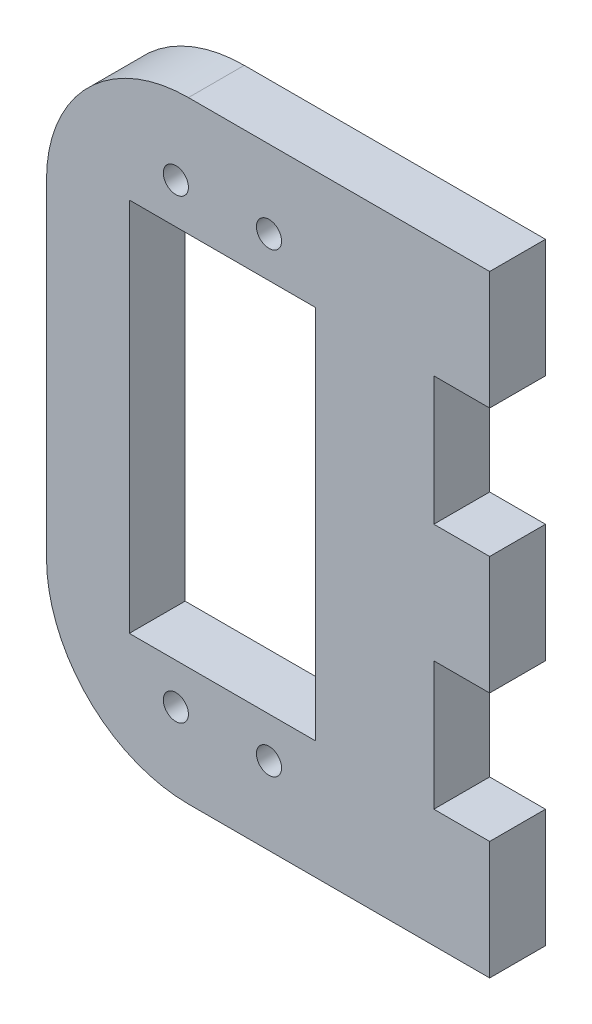
ISO-10303-21;
HEADER;
FILE_DESCRIPTION(('STEP AP214'),'2;1');
FILE_NAME('part.step','',(''),(''),'','','');
FILE_SCHEMA(('AUTOMOTIVE_DESIGN { 1 0 10303 214 1 1 1 1 }'));
ENDSEC;
DATA;
#1=APPLICATION_CONTEXT('core data for automotive mechanical design processes');
#2=APPLICATION_PROTOCOL_DEFINITION('international standard','automotive_design',2000,#1);
#3=PRODUCT_CONTEXT('',#1,'mechanical');
#4=PRODUCT('Part','Part','',(#3));
#5=PRODUCT_RELATED_PRODUCT_CATEGORY('part','',(#4));
#6=PRODUCT_DEFINITION_FORMATION('','',#4);
#7=PRODUCT_DEFINITION_CONTEXT('part definition',#1,'design');
#8=PRODUCT_DEFINITION('design','',#6,#7);
#9=PRODUCT_DEFINITION_SHAPE('','',#8);
#10=(LENGTH_UNIT() NAMED_UNIT(*) SI_UNIT(.MILLI.,.METRE.));
#11=(NAMED_UNIT(*) PLANE_ANGLE_UNIT() SI_UNIT($,.RADIAN.));
#12=(NAMED_UNIT(*) SI_UNIT($,.STERADIAN.) SOLID_ANGLE_UNIT());
#13=UNCERTAINTY_MEASURE_WITH_UNIT(LENGTH_MEASURE(1.E-05),#10,'distance_accuracy_value','');
#14=(GEOMETRIC_REPRESENTATION_CONTEXT(3) GLOBAL_UNCERTAINTY_ASSIGNED_CONTEXT((#13)) GLOBAL_UNIT_ASSIGNED_CONTEXT((#10,
#11,#12)) REPRESENTATION_CONTEXT('',''));
#15=CARTESIAN_POINT('',(0.,0.,0.));
#16=DIRECTION('',(0.,0.,1.));
#17=DIRECTION('',(1.,0.,0.));
#18=AXIS2_PLACEMENT_3D('',#15,#16,#17);
#19=CARTESIAN_POINT('',(-10.,0.,5.9944));
#20=DIRECTION('',(1.,0.,0.));
#21=DIRECTION('',(0.,0.,-1.));
#22=AXIS2_PLACEMENT_3D('',#19,#20,#21);
#23=PLANE('',#22);
#24=DIRECTION('',(0.,-1.,0.));
#25=VECTOR('',#24,1.);
#26=CARTESIAN_POINT('',(-10.,0.,0.));
#27=LINE('',#26,#25);
#28=CARTESIAN_POINT('',(-10.,20.15,0.));
#29=VERTEX_POINT('',#28);
#30=CARTESIAN_POINT('',(-10.,-20.15,0.));
#31=VERTEX_POINT('',#30);
#32=EDGE_CURVE('E229',#29,#31,#27,.T.);
#33=ORIENTED_EDGE('',*,*,#32,.F.);
#34=DIRECTION('',(0.,0.,-1.));
#35=VECTOR('',#34,1.);
#36=CARTESIAN_POINT('',(-10.,20.15,5.9944));
#37=LINE('',#36,#35);
#38=CARTESIAN_POINT('',(-10.,20.15,5.9944));
#39=VERTEX_POINT('',#38);
#40=EDGE_CURVE('E11',#39,#29,#37,.T.);
#41=ORIENTED_EDGE('',*,*,#40,.F.);
#42=DIRECTION('',(0.,-1.,0.));
#43=VECTOR('',#42,1.);
#44=CARTESIAN_POINT('',(-10.,0.,5.9944));
#45=LINE('',#44,#43);
#46=CARTESIAN_POINT('',(-10.,-20.15,5.9944));
#47=VERTEX_POINT('',#46);
#48=EDGE_CURVE('E180',#39,#47,#45,.T.);
#49=ORIENTED_EDGE('',*,*,#48,.T.);
#50=DIRECTION('',(0.,0.,-1.));
#51=VECTOR('',#50,1.);
#52=CARTESIAN_POINT('',(-10.,-20.15,5.9944));
#53=LINE('',#52,#51);
#54=EDGE_CURVE('E116',#47,#31,#53,.T.);
#55=ORIENTED_EDGE('',*,*,#54,.T.);
#56=EDGE_LOOP('',(#33,#41,#49,#55));
#57=FACE_BOUND('',#56,.T.);
#58=ADVANCED_FACE('F33',(#57),#23,.T.);
#59=CARTESIAN_POINT('',(0.,20.15,5.9944));
#60=DIRECTION('',(0.,1.,0.));
#61=DIRECTION('',(0.,0.,1.));
#62=AXIS2_PLACEMENT_3D('',#59,#60,#61);
#63=PLANE('',#62);
#64=DIRECTION('',(1.,0.,0.));
#65=VECTOR('',#64,1.);
#66=CARTESIAN_POINT('',(0.,20.15,0.));
#67=LINE('',#66,#65);
#68=CARTESIAN_POINT('',(10.,20.15,0.));
#69=VERTEX_POINT('',#68);
#70=EDGE_CURVE('E185',#29,#69,#67,.T.);
#71=ORIENTED_EDGE('',*,*,#70,.T.);
#72=DIRECTION('',(0.,0.,-1.));
#73=VECTOR('',#72,1.);
#74=CARTESIAN_POINT('',(10.,20.15,5.9944));
#75=LINE('',#74,#73);
#76=CARTESIAN_POINT('',(10.,20.15,5.9944));
#77=VERTEX_POINT('',#76);
#78=EDGE_CURVE('E43',#77,#69,#75,.T.);
#79=ORIENTED_EDGE('',*,*,#78,.F.);
#80=DIRECTION('',(1.,0.,0.));
#81=VECTOR('',#80,1.);
#82=CARTESIAN_POINT('',(0.,20.15,5.9944));
#83=LINE('',#82,#81);
#84=EDGE_CURVE('E176',#39,#77,#83,.T.);
#85=ORIENTED_EDGE('',*,*,#84,.F.);
#86=ORIENTED_EDGE('',*,*,#40,.T.);
#87=EDGE_LOOP('',(#71,#79,#85,#86));
#88=FACE_BOUND('',#87,.T.);
#89=ADVANCED_FACE('F183',(#88),#63,.F.);
#90=CARTESIAN_POINT('',(10.,0.,5.9944));
#91=DIRECTION('',(1.,0.,0.));
#92=DIRECTION('',(0.,0.,-1.));
#93=AXIS2_PLACEMENT_3D('',#90,#91,#92);
#94=PLANE('',#93);
#95=DIRECTION('',(0.,-1.,0.));
#96=VECTOR('',#95,1.);
#97=CARTESIAN_POINT('',(10.,0.,0.));
#98=LINE('',#97,#96);
#99=CARTESIAN_POINT('',(10.,-20.15,0.));
#100=VERTEX_POINT('',#99);
#101=EDGE_CURVE('E226',#69,#100,#98,.T.);
#102=ORIENTED_EDGE('',*,*,#101,.T.);
#103=DIRECTION('',(0.,0.,-1.));
#104=VECTOR('',#103,1.);
#105=CARTESIAN_POINT('',(10.,-20.15,5.9944));
#106=LINE('',#105,#104);
#107=CARTESIAN_POINT('',(10.,-20.15,5.9944));
#108=VERTEX_POINT('',#107);
#109=EDGE_CURVE('E175',#108,#100,#106,.T.);
#110=ORIENTED_EDGE('',*,*,#109,.F.);
#111=DIRECTION('',(0.,-1.,0.));
#112=VECTOR('',#111,1.);
#113=CARTESIAN_POINT('',(10.,0.,5.9944));
#114=LINE('',#113,#112);
#115=EDGE_CURVE('E169',#77,#108,#114,.T.);
#116=ORIENTED_EDGE('',*,*,#115,.F.);
#117=ORIENTED_EDGE('',*,*,#78,.T.);
#118=EDGE_LOOP('',(#102,#110,#116,#117));
#119=FACE_BOUND('',#118,.T.);
#120=ADVANCED_FACE('F172',(#119),#94,.F.);
#121=CARTESIAN_POINT('',(-3.65,17.61,5.9944));
#122=DIRECTION('',(0.,0.,-1.));
#123=DIRECTION('',(-1.,0.,0.));
#124=AXIS2_PLACEMENT_3D('',#121,#122,#123);
#125=CYLINDRICAL_SURFACE('',#124,15.24);
#126=CARTESIAN_POINT('',(-3.65,17.61,0.));
#127=DIRECTION('',(0.,0.,1.));
#128=DIRECTION('',(1.,0.,0.));
#129=AXIS2_PLACEMENT_3D('',#126,#127,#128);
#130=CIRCLE('',#129,15.24);
#131=CARTESIAN_POINT('',(-18.89,17.6099999999999,0.));
#132=VERTEX_POINT('',#131);
#133=CARTESIAN_POINT('',(-3.64999999999989,32.85,0.));
#134=VERTEX_POINT('',#133);
#135=EDGE_CURVE('E279',#132,#134,#130,.F.);
#136=ORIENTED_EDGE('',*,*,#135,.F.);
#137=DIRECTION('',(0.,0.,-1.));
#138=VECTOR('',#137,1.);
#139=CARTESIAN_POINT('',(-18.89,17.6099999999999,5.9944));
#140=LINE('',#139,#138);
#141=CARTESIAN_POINT('',(-18.89,17.6099999999999,5.9944));
#142=VERTEX_POINT('',#141);
#143=EDGE_CURVE('E37',#142,#132,#140,.T.);
#144=ORIENTED_EDGE('',*,*,#143,.F.);
#145=CARTESIAN_POINT('',(-3.65,17.61,5.9944));
#146=DIRECTION('',(0.,0.,1.));
#147=DIRECTION('',(1.,0.,0.));
#148=AXIS2_PLACEMENT_3D('',#145,#146,#147);
#149=CIRCLE('',#148,15.24);
#150=CARTESIAN_POINT('',(-3.64999999999989,32.85,5.9944));
#151=VERTEX_POINT('',#150);
#152=EDGE_CURVE('E225',#142,#151,#149,.F.);
#153=ORIENTED_EDGE('',*,*,#152,.T.);
#154=DIRECTION('',(0.,0.,-1.));
#155=VECTOR('',#154,1.);
#156=CARTESIAN_POINT('',(-3.64999999999989,32.85,5.9944));
#157=LINE('',#156,#155);
#158=EDGE_CURVE('E190',#151,#134,#157,.T.);
#159=ORIENTED_EDGE('',*,*,#158,.T.);
#160=EDGE_LOOP('',(#136,#144,#153,#159));
#161=FACE_BOUND('',#160,.T.);
#162=ADVANCED_FACE('F35',(#161),#125,.T.);
#163=CARTESIAN_POINT('',(-18.89,0.,5.9944));
#164=DIRECTION('',(-1.,0.,0.));
#165=DIRECTION('',(0.,0.,1.));
#166=AXIS2_PLACEMENT_3D('',#163,#164,#165);
#167=PLANE('',#166);
#168=DIRECTION('',(0.,1.,0.));
#169=VECTOR('',#168,1.);
#170=CARTESIAN_POINT('',(-18.89,0.,0.));
#171=LINE('',#170,#169);
#172=CARTESIAN_POINT('',(-18.89,-17.6099999999999,0.));
#173=VERTEX_POINT('',#172);
#174=EDGE_CURVE('E276',#173,#132,#171,.T.);
#175=ORIENTED_EDGE('',*,*,#174,.F.);
#176=DIRECTION('',(0.,0.,-1.));
#177=VECTOR('',#176,1.);
#178=CARTESIAN_POINT('',(-18.89,-17.6099999999999,5.9944));
#179=LINE('',#178,#177);
#180=CARTESIAN_POINT('',(-18.89,-17.6099999999999,5.9944));
#181=VERTEX_POINT('',#180);
#182=EDGE_CURVE('E216',#181,#173,#179,.T.);
#183=ORIENTED_EDGE('',*,*,#182,.F.);
#184=DIRECTION('',(0.,1.,0.));
#185=VECTOR('',#184,1.);
#186=CARTESIAN_POINT('',(-18.89,0.,5.9944));
#187=LINE('',#186,#185);
#188=EDGE_CURVE('E327',#181,#142,#187,.T.);
#189=ORIENTED_EDGE('',*,*,#188,.T.);
#190=ORIENTED_EDGE('',*,*,#143,.T.);
#191=EDGE_LOOP('',(#175,#183,#189,#190));
#192=FACE_BOUND('',#191,.T.);
#193=ADVANCED_FACE('F343',(#192),#167,.T.);
#194=CARTESIAN_POINT('',(-3.65,-17.61,5.9944));
#195=DIRECTION('',(0.,0.,-1.));
#196=DIRECTION('',(-1.,0.,0.));
#197=AXIS2_PLACEMENT_3D('',#194,#195,#196);
#198=CYLINDRICAL_SURFACE('',#197,15.24);
#199=CARTESIAN_POINT('',(-3.65,-17.61,0.));
#200=DIRECTION('',(0.,0.,1.));
#201=DIRECTION('',(1.,0.,0.));
#202=AXIS2_PLACEMENT_3D('',#199,#200,#201);
#203=CIRCLE('',#202,15.24);
#204=CARTESIAN_POINT('',(-3.64999999999989,-32.85,0.));
#205=VERTEX_POINT('',#204);
#206=EDGE_CURVE('E274',#173,#205,#203,.T.);
#207=ORIENTED_EDGE('',*,*,#206,.T.);
#208=DIRECTION('',(0.,0.,-1.));
#209=VECTOR('',#208,1.);
#210=CARTESIAN_POINT('',(-3.64999999999989,-32.85,5.9944));
#211=LINE('',#210,#209);
#212=CARTESIAN_POINT('',(-3.64999999999989,-32.85,5.9944));
#213=VERTEX_POINT('',#212);
#214=EDGE_CURVE('E214',#213,#205,#211,.T.);
#215=ORIENTED_EDGE('',*,*,#214,.F.);
#216=CARTESIAN_POINT('',(-3.65,-17.61,5.9944));
#217=DIRECTION('',(0.,0.,1.));
#218=DIRECTION('',(1.,0.,0.));
#219=AXIS2_PLACEMENT_3D('',#216,#217,#218);
#220=CIRCLE('',#219,15.24);
#221=EDGE_CURVE('E325',#181,#213,#220,.T.);
#222=ORIENTED_EDGE('',*,*,#221,.F.);
#223=ORIENTED_EDGE('',*,*,#182,.T.);
#224=EDGE_LOOP('',(#207,#215,#222,#223));
#225=FACE_BOUND('',#224,.T.);
#226=ADVANCED_FACE('F345',(#225),#198,.T.);
#227=CARTESIAN_POINT('',(0.,-32.85,5.9944));
#228=DIRECTION('',(0.,1.,0.));
#229=DIRECTION('',(0.,0.,1.));
#230=AXIS2_PLACEMENT_3D('',#227,#228,#229);
#231=PLANE('',#230);
#232=DIRECTION('',(1.,0.,0.));
#233=VECTOR('',#232,1.);
#234=CARTESIAN_POINT('',(0.,-32.85,0.));
#235=LINE('',#234,#233);
#236=CARTESIAN_POINT('',(28.6944,-32.85,0.));
#237=VERTEX_POINT('',#236);
#238=EDGE_CURVE('E272',#205,#237,#235,.T.);
#239=ORIENTED_EDGE('',*,*,#238,.T.);
#240=DIRECTION('',(0.,0.,-1.));
#241=VECTOR('',#240,1.);
#242=CARTESIAN_POINT('',(28.6944,-32.85,5.9944));
#243=LINE('',#242,#241);
#244=CARTESIAN_POINT('',(28.6944,-32.85,5.9944));
#245=VERTEX_POINT('',#244);
#246=EDGE_CURVE('E211',#245,#237,#243,.T.);
#247=ORIENTED_EDGE('',*,*,#246,.F.);
#248=DIRECTION('',(1.,0.,0.));
#249=VECTOR('',#248,1.);
#250=CARTESIAN_POINT('',(0.,-32.85,5.9944));
#251=LINE('',#250,#249);
#252=EDGE_CURVE('E323',#213,#245,#251,.T.);
#253=ORIENTED_EDGE('',*,*,#252,.F.);
#254=ORIENTED_EDGE('',*,*,#214,.T.);
#255=EDGE_LOOP('',(#239,#247,#253,#254));
#256=FACE_BOUND('',#255,.T.);
#257=ADVANCED_FACE('F351',(#256),#231,.F.);
#258=CARTESIAN_POINT('',(28.6944,0.,5.9944));
#259=DIRECTION('',(-1.,0.,0.));
#260=DIRECTION('',(0.,0.,1.));
#261=AXIS2_PLACEMENT_3D('',#258,#259,#260);
#262=PLANE('',#261);
#263=DIRECTION('',(0.,1.,0.));
#264=VECTOR('',#263,1.);
#265=CARTESIAN_POINT('',(28.6944,0.,0.));
#266=LINE('',#265,#264);
#267=CARTESIAN_POINT('',(28.6944,-20.15,0.));
#268=VERTEX_POINT('',#267);
#269=EDGE_CURVE('E270',#237,#268,#266,.T.);
#270=ORIENTED_EDGE('',*,*,#269,.T.);
#271=DIRECTION('',(0.,0.,-1.));
#272=VECTOR('',#271,1.);
#273=CARTESIAN_POINT('',(28.6944,-20.15,5.9944));
#274=LINE('',#273,#272);
#275=CARTESIAN_POINT('',(28.6944,-20.15,5.9944));
#276=VERTEX_POINT('',#275);
#277=EDGE_CURVE('E208',#276,#268,#274,.T.);
#278=ORIENTED_EDGE('',*,*,#277,.F.);
#279=DIRECTION('',(0.,1.,0.));
#280=VECTOR('',#279,1.);
#281=CARTESIAN_POINT('',(28.6944,0.,5.9944));
#282=LINE('',#281,#280);
#283=EDGE_CURVE('E321',#245,#276,#282,.T.);
#284=ORIENTED_EDGE('',*,*,#283,.F.);
#285=ORIENTED_EDGE('',*,*,#246,.T.);
#286=EDGE_LOOP('',(#270,#278,#284,#285));
#287=FACE_BOUND('',#286,.T.);
#288=ADVANCED_FACE('F354',(#287),#262,.F.);
#289=CARTESIAN_POINT('',(0.,-20.15,5.9944));
#290=DIRECTION('',(0.,-1.,0.));
#291=DIRECTION('',(0.,0.,-1.));
#292=AXIS2_PLACEMENT_3D('',#289,#290,#291);
#293=PLANE('',#292);
#294=DIRECTION('',(-1.,0.,0.));
#295=VECTOR('',#294,1.);
#296=CARTESIAN_POINT('',(0.,-20.15,0.));
#297=LINE('',#296,#295);
#298=CARTESIAN_POINT('',(22.7,-20.15,0.));
#299=VERTEX_POINT('',#298);
#300=EDGE_CURVE('E267',#268,#299,#297,.T.);
#301=ORIENTED_EDGE('',*,*,#300,.T.);
#302=DIRECTION('',(0.,0.,-1.));
#303=VECTOR('',#302,1.);
#304=CARTESIAN_POINT('',(22.7,-20.15,5.9944));
#305=LINE('',#304,#303);
#306=CARTESIAN_POINT('',(22.7,-20.15,5.9944));
#307=VERTEX_POINT('',#306);
#308=EDGE_CURVE('E206',#307,#299,#305,.T.);
#309=ORIENTED_EDGE('',*,*,#308,.F.);
#310=DIRECTION('',(-1.,0.,0.));
#311=VECTOR('',#310,1.);
#312=CARTESIAN_POINT('',(0.,-20.15,5.9944));
#313=LINE('',#312,#311);
#314=EDGE_CURVE('E319',#276,#307,#313,.T.);
#315=ORIENTED_EDGE('',*,*,#314,.F.);
#316=ORIENTED_EDGE('',*,*,#277,.T.);
#317=EDGE_LOOP('',(#301,#309,#315,#316));
#318=FACE_BOUND('',#317,.T.);
#319=ADVANCED_FACE('F359',(#318),#293,.F.);
#320=CARTESIAN_POINT('',(22.7,0.,5.9944));
#321=DIRECTION('',(1.,0.,0.));
#322=DIRECTION('',(0.,0.,-1.));
#323=AXIS2_PLACEMENT_3D('',#320,#321,#322);
#324=PLANE('',#323);
#325=DIRECTION('',(0.,-1.,0.));
#326=VECTOR('',#325,1.);
#327=CARTESIAN_POINT('',(22.7,0.,0.));
#328=LINE('',#327,#326);
#329=CARTESIAN_POINT('',(22.7,-6.35,0.));
#330=VERTEX_POINT('',#329);
#331=EDGE_CURVE('E264',#330,#299,#328,.T.);
#332=ORIENTED_EDGE('',*,*,#331,.F.);
#333=DIRECTION('',(0.,0.,-1.));
#334=VECTOR('',#333,1.);
#335=CARTESIAN_POINT('',(22.7,-6.35,5.9944));
#336=LINE('',#335,#334);
#337=CARTESIAN_POINT('',(22.7,-6.35,5.9944));
#338=VERTEX_POINT('',#337);
#339=EDGE_CURVE('E204',#338,#330,#336,.T.);
#340=ORIENTED_EDGE('',*,*,#339,.F.);
#341=DIRECTION('',(0.,-1.,0.));
#342=VECTOR('',#341,1.);
#343=CARTESIAN_POINT('',(22.7,0.,5.9944));
#344=LINE('',#343,#342);
#345=EDGE_CURVE('E316',#338,#307,#344,.T.);
#346=ORIENTED_EDGE('',*,*,#345,.T.);
#347=ORIENTED_EDGE('',*,*,#308,.T.);
#348=EDGE_LOOP('',(#332,#340,#346,#347));
#349=FACE_BOUND('',#348,.T.);
#350=ADVANCED_FACE('F445',(#349),#324,.T.);
#351=CARTESIAN_POINT('',(0.,-6.35,5.9944));
#352=DIRECTION('',(0.,-1.,0.));
#353=DIRECTION('',(1.,0.,0.));
#354=AXIS2_PLACEMENT_3D('',#351,#352,#353);
#355=PLANE('',#354);
#356=DIRECTION('',(-1.,0.,0.));
#357=VECTOR('',#356,1.);
#358=CARTESIAN_POINT('',(0.,-6.35,0.));
#359=LINE('',#358,#357);
#360=CARTESIAN_POINT('',(28.6944,-6.35,0.));
#361=VERTEX_POINT('',#360);
#362=EDGE_CURVE('E261',#361,#330,#359,.T.);
#363=ORIENTED_EDGE('',*,*,#362,.F.);
#364=DIRECTION('',(0.,0.,-1.));
#365=VECTOR('',#364,1.);
#366=CARTESIAN_POINT('',(28.6944,-6.35,5.9944));
#367=LINE('',#366,#365);
#368=CARTESIAN_POINT('',(28.6944,-6.35,5.9944));
#369=VERTEX_POINT('',#368);
#370=EDGE_CURVE('E202',#369,#361,#367,.T.);
#371=ORIENTED_EDGE('',*,*,#370,.F.);
#372=DIRECTION('',(-1.,0.,0.));
#373=VECTOR('',#372,1.);
#374=CARTESIAN_POINT('',(0.,-6.35,5.9944));
#375=LINE('',#374,#373);
#376=EDGE_CURVE('E313',#369,#338,#375,.T.);
#377=ORIENTED_EDGE('',*,*,#376,.T.);
#378=ORIENTED_EDGE('',*,*,#339,.T.);
#379=EDGE_LOOP('',(#363,#371,#377,#378));
#380=FACE_BOUND('',#379,.T.);
#381=ADVANCED_FACE('F366',(#380),#355,.T.);
#382=CARTESIAN_POINT('',(28.6944,0.,5.9944));
#383=DIRECTION('',(1.,0.,0.));
#384=DIRECTION('',(0.,0.,-1.));
#385=AXIS2_PLACEMENT_3D('',#382,#383,#384);
#386=PLANE('',#385);
#387=DIRECTION('',(0.,-1.,0.));
#388=VECTOR('',#387,1.);
#389=CARTESIAN_POINT('',(28.6944,0.,0.));
#390=LINE('',#389,#388);
#391=CARTESIAN_POINT('',(28.6944,6.35,0.));
#392=VERTEX_POINT('',#391);
#393=EDGE_CURVE('E258',#392,#361,#390,.T.);
#394=ORIENTED_EDGE('',*,*,#393,.F.);
#395=DIRECTION('',(0.,0.,-1.));
#396=VECTOR('',#395,1.);
#397=CARTESIAN_POINT('',(28.6944,6.35,5.9944));
#398=LINE('',#397,#396);
#399=CARTESIAN_POINT('',(28.6944,6.35,5.9944));
#400=VERTEX_POINT('',#399);
#401=EDGE_CURVE('E200',#400,#392,#398,.T.);
#402=ORIENTED_EDGE('',*,*,#401,.F.);
#403=DIRECTION('',(0.,-1.,0.));
#404=VECTOR('',#403,1.);
#405=CARTESIAN_POINT('',(28.6944,0.,5.9944));
#406=LINE('',#405,#404);
#407=EDGE_CURVE('E310',#400,#369,#406,.T.);
#408=ORIENTED_EDGE('',*,*,#407,.T.);
#409=ORIENTED_EDGE('',*,*,#370,.T.);
#410=EDGE_LOOP('',(#394,#402,#408,#409));
#411=FACE_BOUND('',#410,.T.);
#412=ADVANCED_FACE('F370',(#411),#386,.T.);
#413=CARTESIAN_POINT('',(0.,6.35,5.9944));
#414=DIRECTION('',(0.,-1.,0.));
#415=DIRECTION('',(0.,0.,-1.));
#416=AXIS2_PLACEMENT_3D('',#413,#414,#415);
#417=PLANE('',#416);
#418=DIRECTION('',(-1.,0.,0.));
#419=VECTOR('',#418,1.);
#420=CARTESIAN_POINT('',(0.,6.35,0.));
#421=LINE('',#420,#419);
#422=CARTESIAN_POINT('',(22.7,6.35,0.));
#423=VERTEX_POINT('',#422);
#424=EDGE_CURVE('E255',#392,#423,#421,.T.);
#425=ORIENTED_EDGE('',*,*,#424,.T.);
#426=DIRECTION('',(0.,0.,-1.));
#427=VECTOR('',#426,1.);
#428=CARTESIAN_POINT('',(22.7,6.35,5.9944));
#429=LINE('',#428,#427);
#430=CARTESIAN_POINT('',(22.7,6.35,5.9944));
#431=VERTEX_POINT('',#430);
#432=EDGE_CURVE('E198',#431,#423,#429,.T.);
#433=ORIENTED_EDGE('',*,*,#432,.F.);
#434=DIRECTION('',(-1.,0.,0.));
#435=VECTOR('',#434,1.);
#436=CARTESIAN_POINT('',(0.,6.35,5.9944));
#437=LINE('',#436,#435);
#438=EDGE_CURVE('E308',#400,#431,#437,.T.);
#439=ORIENTED_EDGE('',*,*,#438,.F.);
#440=ORIENTED_EDGE('',*,*,#401,.T.);
#441=EDGE_LOOP('',(#425,#433,#439,#440));
#442=FACE_BOUND('',#441,.T.);
#443=ADVANCED_FACE('F375',(#442),#417,.F.);
#444=CARTESIAN_POINT('',(22.7,0.,5.9944));
#445=DIRECTION('',(1.,0.,0.));
#446=DIRECTION('',(0.,0.,-1.));
#447=AXIS2_PLACEMENT_3D('',#444,#445,#446);
#448=PLANE('',#447);
#449=DIRECTION('',(0.,-1.,0.));
#450=VECTOR('',#449,1.);
#451=CARTESIAN_POINT('',(22.7,0.,0.));
#452=LINE('',#451,#450);
#453=CARTESIAN_POINT('',(22.7,20.15,0.));
#454=VERTEX_POINT('',#453);
#455=EDGE_CURVE('E252',#454,#423,#452,.T.);
#456=ORIENTED_EDGE('',*,*,#455,.F.);
#457=DIRECTION('',(0.,0.,-1.));
#458=VECTOR('',#457,1.);
#459=CARTESIAN_POINT('',(22.7,20.15,5.9944));
#460=LINE('',#459,#458);
#461=CARTESIAN_POINT('',(22.7,20.15,5.9944));
#462=VERTEX_POINT('',#461);
#463=EDGE_CURVE('E196',#462,#454,#460,.T.);
#464=ORIENTED_EDGE('',*,*,#463,.F.);
#465=DIRECTION('',(0.,-1.,0.));
#466=VECTOR('',#465,1.);
#467=CARTESIAN_POINT('',(22.7,0.,5.9944));
#468=LINE('',#467,#466);
#469=EDGE_CURVE('E305',#462,#431,#468,.T.);
#470=ORIENTED_EDGE('',*,*,#469,.T.);
#471=ORIENTED_EDGE('',*,*,#432,.T.);
#472=EDGE_LOOP('',(#456,#464,#470,#471));
#473=FACE_BOUND('',#472,.T.);
#474=ADVANCED_FACE('F379',(#473),#448,.T.);
#475=CARTESIAN_POINT('',(0.,20.15,5.9944));
#476=DIRECTION('',(0.,-1.,0.));
#477=DIRECTION('',(0.,0.,-1.));
#478=AXIS2_PLACEMENT_3D('',#475,#476,#477);
#479=PLANE('',#478);
#480=DIRECTION('',(-1.,0.,0.));
#481=VECTOR('',#480,1.);
#482=CARTESIAN_POINT('',(0.,20.15,0.));
#483=LINE('',#482,#481);
#484=CARTESIAN_POINT('',(28.6944,20.15,0.));
#485=VERTEX_POINT('',#484);
#486=EDGE_CURVE('E249',#485,#454,#483,.T.);
#487=ORIENTED_EDGE('',*,*,#486,.F.);
#488=DIRECTION('',(0.,0.,-1.));
#489=VECTOR('',#488,1.);
#490=CARTESIAN_POINT('',(28.6944,20.15,5.9944));
#491=LINE('',#490,#489);
#492=CARTESIAN_POINT('',(28.6944,20.15,5.9944));
#493=VERTEX_POINT('',#492);
#494=EDGE_CURVE('E194',#493,#485,#491,.T.);
#495=ORIENTED_EDGE('',*,*,#494,.F.);
#496=DIRECTION('',(-1.,0.,0.));
#497=VECTOR('',#496,1.);
#498=CARTESIAN_POINT('',(0.,20.15,5.9944));
#499=LINE('',#498,#497);
#500=EDGE_CURVE('E302',#493,#462,#499,.T.);
#501=ORIENTED_EDGE('',*,*,#500,.T.);
#502=ORIENTED_EDGE('',*,*,#463,.T.);
#503=EDGE_LOOP('',(#487,#495,#501,#502));
#504=FACE_BOUND('',#503,.T.);
#505=ADVANCED_FACE('F382',(#504),#479,.T.);
#506=CARTESIAN_POINT('',(28.6944,0.,5.9944));
#507=DIRECTION('',(1.,0.,0.));
#508=DIRECTION('',(0.,0.,-1.));
#509=AXIS2_PLACEMENT_3D('',#506,#507,#508);
#510=PLANE('',#509);
#511=DIRECTION('',(0.,-1.,0.));
#512=VECTOR('',#511,1.);
#513=CARTESIAN_POINT('',(28.6944,0.,0.));
#514=LINE('',#513,#512);
#515=CARTESIAN_POINT('',(28.6944,32.85,0.));
#516=VERTEX_POINT('',#515);
#517=EDGE_CURVE('E246',#516,#485,#514,.T.);
#518=ORIENTED_EDGE('',*,*,#517,.F.);
#519=DIRECTION('',(0.,0.,-1.));
#520=VECTOR('',#519,1.);
#521=CARTESIAN_POINT('',(28.6944,32.85,5.9944));
#522=LINE('',#521,#520);
#523=CARTESIAN_POINT('',(28.6944,32.85,5.9944));
#524=VERTEX_POINT('',#523);
#525=EDGE_CURVE('E192',#524,#516,#522,.T.);
#526=ORIENTED_EDGE('',*,*,#525,.F.);
#527=DIRECTION('',(0.,-1.,0.));
#528=VECTOR('',#527,1.);
#529=CARTESIAN_POINT('',(28.6944,0.,5.9944));
#530=LINE('',#529,#528);
#531=EDGE_CURVE('E299',#524,#493,#530,.T.);
#532=ORIENTED_EDGE('',*,*,#531,.T.);
#533=ORIENTED_EDGE('',*,*,#494,.T.);
#534=EDGE_LOOP('',(#518,#526,#532,#533));
#535=FACE_BOUND('',#534,.T.);
#536=ADVANCED_FACE('F384',(#535),#510,.T.);
#537=CARTESIAN_POINT('',(-5.,-24.5,5.9944));
#538=DIRECTION('',(0.,0.,-1.));
#539=DIRECTION('',(-1.,0.,0.));
#540=AXIS2_PLACEMENT_3D('',#537,#538,#539);
#541=CYLINDRICAL_SURFACE('',#540,1.35);
#542=CARTESIAN_POINT('',(-5.,-24.5,5.9944));
#543=DIRECTION('',(0.,0.,1.));
#544=DIRECTION('',(1.,0.,0.));
#545=AXIS2_PLACEMENT_3D('',#542,#543,#544);
#546=CIRCLE('',#545,1.35);
#547=CARTESIAN_POINT('',(-3.65,-24.5,5.9944));
#548=VERTEX_POINT('',#547);
#549=EDGE_CURVE('E284',#548,#548,#546,.T.);
#550=ORIENTED_EDGE('',*,*,#549,.T.);
#551=EDGE_LOOP('',(#550));
#552=FACE_BOUND('',#551,.T.);
#553=CARTESIAN_POINT('',(-5.,-24.5,0.));
#554=DIRECTION('',(0.,0.,1.));
#555=DIRECTION('',(1.,0.,0.));
#556=AXIS2_PLACEMENT_3D('',#553,#554,#555);
#557=CIRCLE('',#556,1.35);
#558=CARTESIAN_POINT('',(-3.65,-24.5,0.));
#559=VERTEX_POINT('',#558);
#560=EDGE_CURVE('E231',#559,#559,#557,.T.);
#561=ORIENTED_EDGE('',*,*,#560,.F.);
#562=EDGE_LOOP('',(#561));
#563=FACE_BOUND('',#562,.T.);
#564=ADVANCED_FACE('F386',(#552,#563),#541,.F.);
#565=CARTESIAN_POINT('',(5.,-24.5,5.9944));
#566=DIRECTION('',(0.,0.,-1.));
#567=DIRECTION('',(-1.,0.,0.));
#568=AXIS2_PLACEMENT_3D('',#565,#566,#567);
#569=CYLINDRICAL_SURFACE('',#568,1.35);
#570=CARTESIAN_POINT('',(5.,-24.5,5.9944));
#571=DIRECTION('',(0.,0.,1.));
#572=DIRECTION('',(1.,0.,0.));
#573=AXIS2_PLACEMENT_3D('',#570,#571,#572);
#574=CIRCLE('',#573,1.35);
#575=CARTESIAN_POINT('',(6.35,-24.5,5.9944));
#576=VERTEX_POINT('',#575);
#577=EDGE_CURVE('E287',#576,#576,#574,.T.);
#578=ORIENTED_EDGE('',*,*,#577,.T.);
#579=EDGE_LOOP('',(#578));
#580=FACE_BOUND('',#579,.T.);
#581=CARTESIAN_POINT('',(5.,-24.5,0.));
#582=DIRECTION('',(0.,0.,1.));
#583=DIRECTION('',(1.,0.,0.));
#584=AXIS2_PLACEMENT_3D('',#581,#582,#583);
#585=CIRCLE('',#584,1.35);
#586=CARTESIAN_POINT('',(6.35,-24.5,0.));
#587=VERTEX_POINT('',#586);
#588=EDGE_CURVE('E234',#587,#587,#585,.T.);
#589=ORIENTED_EDGE('',*,*,#588,.F.);
#590=EDGE_LOOP('',(#589));
#591=FACE_BOUND('',#590,.T.);
#592=ADVANCED_FACE('F392',(#580,#591),#569,.F.);
#593=CARTESIAN_POINT('',(-5.,24.5,5.9944));
#594=DIRECTION('',(0.,0.,-1.));
#595=DIRECTION('',(-1.,0.,0.));
#596=AXIS2_PLACEMENT_3D('',#593,#594,#595);
#597=CYLINDRICAL_SURFACE('',#596,1.35);
#598=CARTESIAN_POINT('',(-5.,24.5,5.9944));
#599=DIRECTION('',(0.,0.,1.));
#600=DIRECTION('',(1.,0.,0.));
#601=AXIS2_PLACEMENT_3D('',#598,#599,#600);
#602=CIRCLE('',#601,1.35);
#603=CARTESIAN_POINT('',(-3.65,24.5,5.9944));
#604=VERTEX_POINT('',#603);
#605=EDGE_CURVE('E290',#604,#604,#602,.T.);
#606=ORIENTED_EDGE('',*,*,#605,.T.);
#607=EDGE_LOOP('',(#606));
#608=FACE_BOUND('',#607,.T.);
#609=CARTESIAN_POINT('',(-5.,24.5,0.));
#610=DIRECTION('',(0.,0.,1.));
#611=DIRECTION('',(1.,0.,0.));
#612=AXIS2_PLACEMENT_3D('',#609,#610,#611);
#613=CIRCLE('',#612,1.35);
#614=CARTESIAN_POINT('',(-3.65,24.5,0.));
#615=VERTEX_POINT('',#614);
#616=EDGE_CURVE('E237',#615,#615,#613,.T.);
#617=ORIENTED_EDGE('',*,*,#616,.F.);
#618=EDGE_LOOP('',(#617));
#619=FACE_BOUND('',#618,.T.);
#620=ADVANCED_FACE('F407',(#608,#619),#597,.F.);
#621=CARTESIAN_POINT('',(5.,24.5,5.9944));
#622=DIRECTION('',(0.,0.,-1.));
#623=DIRECTION('',(-1.,0.,0.));
#624=AXIS2_PLACEMENT_3D('',#621,#622,#623);
#625=CYLINDRICAL_SURFACE('',#624,1.35);
#626=CARTESIAN_POINT('',(5.,24.5,5.9944));
#627=DIRECTION('',(0.,0.,1.));
#628=DIRECTION('',(1.,0.,0.));
#629=AXIS2_PLACEMENT_3D('',#626,#627,#628);
#630=CIRCLE('',#629,1.35);
#631=CARTESIAN_POINT('',(6.35,24.5,5.9944));
#632=VERTEX_POINT('',#631);
#633=EDGE_CURVE('E293',#632,#632,#630,.T.);
#634=ORIENTED_EDGE('',*,*,#633,.T.);
#635=EDGE_LOOP('',(#634));
#636=FACE_BOUND('',#635,.T.);
#637=CARTESIAN_POINT('',(5.,24.5,0.));
#638=DIRECTION('',(0.,0.,1.));
#639=DIRECTION('',(1.,0.,0.));
#640=AXIS2_PLACEMENT_3D('',#637,#638,#639);
#641=CIRCLE('',#640,1.35);
#642=CARTESIAN_POINT('',(6.35,24.5,0.));
#643=VERTEX_POINT('',#642);
#644=EDGE_CURVE('E240',#643,#643,#641,.T.);
#645=ORIENTED_EDGE('',*,*,#644,.F.);
#646=EDGE_LOOP('',(#645));
#647=FACE_BOUND('',#646,.T.);
#648=ADVANCED_FACE('F411',(#636,#647),#625,.F.);
#649=CARTESIAN_POINT('',(0.,32.85,5.9944));
#650=DIRECTION('',(0.,1.,0.));
#651=DIRECTION('',(0.,0.,1.));
#652=AXIS2_PLACEMENT_3D('',#649,#650,#651);
#653=PLANE('',#652);
#654=DIRECTION('',(1.,0.,0.));
#655=VECTOR('',#654,1.);
#656=CARTESIAN_POINT('',(0.,32.85,0.));
#657=LINE('',#656,#655);
#658=EDGE_CURVE('E243',#134,#516,#657,.T.);
#659=ORIENTED_EDGE('',*,*,#658,.F.);
#660=ORIENTED_EDGE('',*,*,#158,.F.);
#661=DIRECTION('',(1.,0.,0.));
#662=VECTOR('',#661,1.);
#663=CARTESIAN_POINT('',(0.,32.85,5.9944));
#664=LINE('',#663,#662);
#665=EDGE_CURVE('E296',#151,#524,#664,.T.);
#666=ORIENTED_EDGE('',*,*,#665,.T.);
#667=ORIENTED_EDGE('',*,*,#525,.T.);
#668=EDGE_LOOP('',(#659,#660,#666,#667));
#669=FACE_BOUND('',#668,.T.);
#670=ADVANCED_FACE('F337',(#669),#653,.T.);
#671=CARTESIAN_POINT('',(0.,-20.15,5.9944));
#672=DIRECTION('',(0.,-1.,0.));
#673=DIRECTION('',(0.,0.,-1.));
#674=AXIS2_PLACEMENT_3D('',#671,#672,#673);
#675=PLANE('',#674);
#676=DIRECTION('',(-1.,0.,0.));
#677=VECTOR('',#676,1.);
#678=CARTESIAN_POINT('',(0.,-20.15,0.));
#679=LINE('',#678,#677);
#680=EDGE_CURVE('E109',#100,#31,#679,.T.);
#681=ORIENTED_EDGE('',*,*,#680,.T.);
#682=ORIENTED_EDGE('',*,*,#54,.F.);
#683=DIRECTION('',(-1.,0.,0.));
#684=VECTOR('',#683,1.);
#685=CARTESIAN_POINT('',(0.,-20.15,5.9944));
#686=LINE('',#685,#684);
#687=EDGE_CURVE('E52',#108,#47,#686,.T.);
#688=ORIENTED_EDGE('',*,*,#687,.F.);
#689=ORIENTED_EDGE('',*,*,#109,.T.);
#690=EDGE_LOOP('',(#681,#682,#688,#689));
#691=FACE_BOUND('',#690,.T.);
#692=ADVANCED_FACE('F416',(#691),#675,.F.);
#693=CARTESIAN_POINT('',(0.,0.,5.9944));
#694=DIRECTION('',(0.,0.,1.));
#695=DIRECTION('',(1.,0.,0.));
#696=AXIS2_PLACEMENT_3D('',#693,#694,#695);
#697=PLANE('',#696);
#698=ORIENTED_EDGE('',*,*,#152,.F.);
#699=ORIENTED_EDGE('',*,*,#188,.F.);
#700=ORIENTED_EDGE('',*,*,#221,.T.);
#701=ORIENTED_EDGE('',*,*,#252,.T.);
#702=ORIENTED_EDGE('',*,*,#283,.T.);
#703=ORIENTED_EDGE('',*,*,#314,.T.);
#704=ORIENTED_EDGE('',*,*,#345,.F.);
#705=ORIENTED_EDGE('',*,*,#376,.F.);
#706=ORIENTED_EDGE('',*,*,#407,.F.);
#707=ORIENTED_EDGE('',*,*,#438,.T.);
#708=ORIENTED_EDGE('',*,*,#469,.F.);
#709=ORIENTED_EDGE('',*,*,#500,.F.);
#710=ORIENTED_EDGE('',*,*,#531,.F.);
#711=ORIENTED_EDGE('',*,*,#665,.F.);
#712=EDGE_LOOP('',(#698,#699,#700,#701,#702,#703,#704,#705,#706,#707,#708,#709,#710,#711));
#713=FACE_BOUND('',#712,.T.);
#714=ORIENTED_EDGE('',*,*,#633,.F.);
#715=EDGE_LOOP('',(#714));
#716=FACE_BOUND('',#715,.T.);
#717=ORIENTED_EDGE('',*,*,#605,.F.);
#718=EDGE_LOOP('',(#717));
#719=FACE_BOUND('',#718,.T.);
#720=ORIENTED_EDGE('',*,*,#577,.F.);
#721=EDGE_LOOP('',(#720));
#722=FACE_BOUND('',#721,.T.);
#723=ORIENTED_EDGE('',*,*,#549,.F.);
#724=EDGE_LOOP('',(#723));
#725=FACE_BOUND('',#724,.T.);
#726=ORIENTED_EDGE('',*,*,#48,.F.);
#727=ORIENTED_EDGE('',*,*,#84,.T.);
#728=ORIENTED_EDGE('',*,*,#115,.T.);
#729=ORIENTED_EDGE('',*,*,#687,.T.);
#730=EDGE_LOOP('',(#726,#727,#728,#729));
#731=FACE_BOUND('',#730,.T.);
#732=ADVANCED_FACE('F179',(#713,#716,#719,#722,#725,#731),#697,.T.);
#733=CARTESIAN_POINT('',(0.,0.,0.));
#734=DIRECTION('',(0.,0.,1.));
#735=DIRECTION('',(1.,0.,0.));
#736=AXIS2_PLACEMENT_3D('',#733,#734,#735);
#737=PLANE('',#736);
#738=ORIENTED_EDGE('',*,*,#135,.T.);
#739=ORIENTED_EDGE('',*,*,#658,.T.);
#740=ORIENTED_EDGE('',*,*,#517,.T.);
#741=ORIENTED_EDGE('',*,*,#486,.T.);
#742=ORIENTED_EDGE('',*,*,#455,.T.);
#743=ORIENTED_EDGE('',*,*,#424,.F.);
#744=ORIENTED_EDGE('',*,*,#393,.T.);
#745=ORIENTED_EDGE('',*,*,#362,.T.);
#746=ORIENTED_EDGE('',*,*,#331,.T.);
#747=ORIENTED_EDGE('',*,*,#300,.F.);
#748=ORIENTED_EDGE('',*,*,#269,.F.);
#749=ORIENTED_EDGE('',*,*,#238,.F.);
#750=ORIENTED_EDGE('',*,*,#206,.F.);
#751=ORIENTED_EDGE('',*,*,#174,.T.);
#752=EDGE_LOOP('',(#738,#739,#740,#741,#742,#743,#744,#745,#746,#747,#748,#749,#750,#751));
#753=FACE_BOUND('',#752,.T.);
#754=ORIENTED_EDGE('',*,*,#644,.T.);
#755=EDGE_LOOP('',(#754));
#756=FACE_BOUND('',#755,.T.);
#757=ORIENTED_EDGE('',*,*,#616,.T.);
#758=EDGE_LOOP('',(#757));
#759=FACE_BOUND('',#758,.T.);
#760=ORIENTED_EDGE('',*,*,#588,.T.);
#761=EDGE_LOOP('',(#760));
#762=FACE_BOUND('',#761,.T.);
#763=ORIENTED_EDGE('',*,*,#560,.T.);
#764=EDGE_LOOP('',(#763));
#765=FACE_BOUND('',#764,.T.);
#766=ORIENTED_EDGE('',*,*,#32,.T.);
#767=ORIENTED_EDGE('',*,*,#680,.F.);
#768=ORIENTED_EDGE('',*,*,#101,.F.);
#769=ORIENTED_EDGE('',*,*,#70,.F.);
#770=EDGE_LOOP('',(#766,#767,#768,#769));
#771=FACE_BOUND('',#770,.T.);
#772=ADVANCED_FACE('F340',(#753,#756,#759,#762,#765,#771),#737,.F.);
#773=CLOSED_SHELL('',(#58,#89,#120,#162,#193,#226,#257,#288,#319,#350,#381,#412,#443,#474,#505,
#536,#564,#592,#620,#648,#670,#692,#732,#772));
#774=MANIFOLD_SOLID_BREP('B2',#773);
#775=ADVANCED_BREP_SHAPE_REPRESENTATION('',(#18,#774),#14);
#776=SHAPE_DEFINITION_REPRESENTATION(#9,#775);
ENDSEC;
END-ISO-10303-21;
